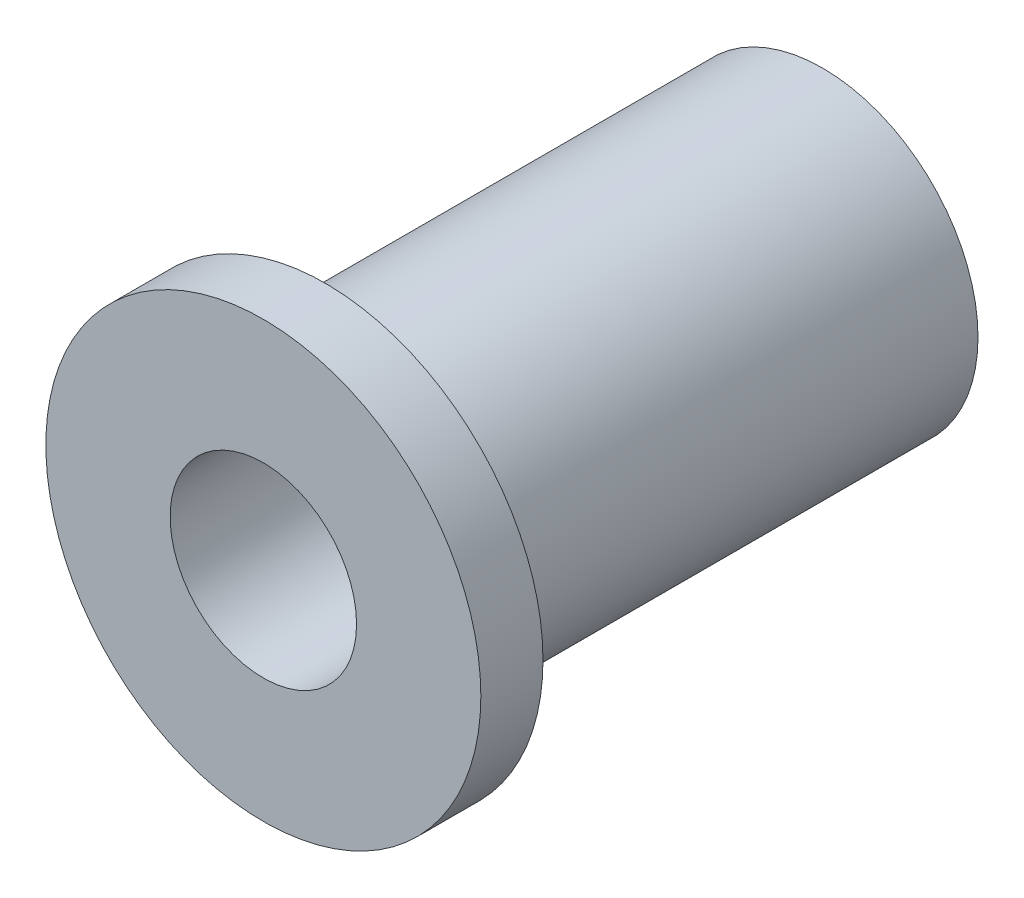
ISO-10303-21;
HEADER;
FILE_DESCRIPTION(('STEP AP214'),'2;1');
FILE_NAME('part.step','',(''),(''),'','','');
FILE_SCHEMA(('AUTOMOTIVE_DESIGN { 1 0 10303 214 1 1 1 1 }'));
ENDSEC;
DATA;
#1=APPLICATION_CONTEXT('core data for automotive mechanical design processes');
#2=APPLICATION_PROTOCOL_DEFINITION('international standard','automotive_design',2000,#1);
#3=PRODUCT_CONTEXT('',#1,'mechanical');
#4=PRODUCT('Part','Part','',(#3));
#5=PRODUCT_RELATED_PRODUCT_CATEGORY('part','',(#4));
#6=PRODUCT_DEFINITION_FORMATION('','',#4);
#7=PRODUCT_DEFINITION_CONTEXT('part definition',#1,'design');
#8=PRODUCT_DEFINITION('design','',#6,#7);
#9=PRODUCT_DEFINITION_SHAPE('','',#8);
#10=(LENGTH_UNIT() NAMED_UNIT(*) SI_UNIT(.MILLI.,.METRE.));
#11=(NAMED_UNIT(*) PLANE_ANGLE_UNIT() SI_UNIT($,.RADIAN.));
#12=(NAMED_UNIT(*) SI_UNIT($,.STERADIAN.) SOLID_ANGLE_UNIT());
#13=UNCERTAINTY_MEASURE_WITH_UNIT(LENGTH_MEASURE(1.E-05),#10,'distance_accuracy_value','');
#14=(GEOMETRIC_REPRESENTATION_CONTEXT(3) GLOBAL_UNCERTAINTY_ASSIGNED_CONTEXT((#13)) GLOBAL_UNIT_ASSIGNED_CONTEXT((#10,
#11,#12)) REPRESENTATION_CONTEXT('',''));
#15=CARTESIAN_POINT('',(0.,0.,0.));
#16=DIRECTION('',(0.,0.,1.));
#17=DIRECTION('',(1.,0.,0.));
#18=AXIS2_PLACEMENT_3D('',#15,#16,#17);
#19=CARTESIAN_POINT('',(0.,0.,0.));
#20=DIRECTION('',(0.,0.,1.));
#21=DIRECTION('',(1.,0.,0.));
#22=AXIS2_PLACEMENT_3D('',#19,#20,#21);
#23=PLANE('',#22);
#24=CARTESIAN_POINT('',(0.,0.,0.));
#25=DIRECTION('',(0.,0.,1.));
#26=DIRECTION('',(1.,0.,0.));
#27=AXIS2_PLACEMENT_3D('',#24,#25,#26);
#28=CIRCLE('',#27,5.55625);
#29=CARTESIAN_POINT('',(5.55625,0.,0.));
#30=VERTEX_POINT('',#29);
#31=EDGE_CURVE('E45',#30,#30,#28,.T.);
#32=ORIENTED_EDGE('',*,*,#31,.F.);
#33=EDGE_LOOP('',(#32));
#34=FACE_BOUND('',#33,.T.);
#35=CARTESIAN_POINT('',(0.,0.,0.));
#36=DIRECTION('',(0.,0.,1.));
#37=DIRECTION('',(1.,0.,0.));
#38=AXIS2_PLACEMENT_3D('',#35,#36,#37);
#39=CIRCLE('',#38,3.96875);
#40=CARTESIAN_POINT('',(3.96875,0.,0.));
#41=VERTEX_POINT('',#40);
#42=EDGE_CURVE('E10',#41,#41,#39,.F.);
#43=ORIENTED_EDGE('',*,*,#42,.F.);
#44=EDGE_LOOP('',(#43));
#45=FACE_BOUND('',#44,.T.);
#46=ADVANCED_FACE('F34',(#34,#45),#23,.F.);
#47=CARTESIAN_POINT('',(0.,0.,1.5875));
#48=DIRECTION('',(0.,0.,-1.));
#49=DIRECTION('',(-1.,0.,0.));
#50=AXIS2_PLACEMENT_3D('',#47,#48,#49);
#51=CYLINDRICAL_SURFACE('',#50,5.55625);
#52=CARTESIAN_POINT('',(0.,0.,1.5875));
#53=DIRECTION('',(0.,0.,1.));
#54=DIRECTION('',(1.,0.,0.));
#55=AXIS2_PLACEMENT_3D('',#52,#53,#54);
#56=CIRCLE('',#55,5.55625);
#57=CARTESIAN_POINT('',(5.55625,0.,1.5875));
#58=VERTEX_POINT('',#57);
#59=EDGE_CURVE('E41',#58,#58,#56,.T.);
#60=ORIENTED_EDGE('',*,*,#59,.F.);
#61=EDGE_LOOP('',(#60));
#62=FACE_BOUND('',#61,.T.);
#63=ORIENTED_EDGE('',*,*,#31,.T.);
#64=EDGE_LOOP('',(#63));
#65=FACE_BOUND('',#64,.T.);
#66=ADVANCED_FACE('F36',(#62,#65),#51,.T.);
#67=CARTESIAN_POINT('',(0.,0.,1.5875));
#68=DIRECTION('',(0.,0.,1.));
#69=DIRECTION('',(1.,0.,0.));
#70=AXIS2_PLACEMENT_3D('',#67,#68,#69);
#71=PLANE('',#70);
#72=CARTESIAN_POINT('',(0.,0.,1.5875));
#73=DIRECTION('',(0.,0.,1.));
#74=DIRECTION('',(1.,0.,0.));
#75=AXIS2_PLACEMENT_3D('',#72,#73,#74);
#76=CIRCLE('',#75,2.38125);
#77=CARTESIAN_POINT('',(2.38125,0.,1.5875));
#78=VERTEX_POINT('',#77);
#79=EDGE_CURVE('E55',#78,#78,#76,.T.);
#80=ORIENTED_EDGE('',*,*,#79,.F.);
#81=EDGE_LOOP('',(#80));
#82=FACE_BOUND('',#81,.T.);
#83=ORIENTED_EDGE('',*,*,#59,.T.);
#84=EDGE_LOOP('',(#83));
#85=FACE_BOUND('',#84,.T.);
#86=ADVANCED_FACE('F70',(#82,#85),#71,.T.);
#87=CARTESIAN_POINT('',(0.,0.,-12.7));
#88=DIRECTION('',(0.,0.,1.));
#89=DIRECTION('',(1.,0.,0.));
#90=AXIS2_PLACEMENT_3D('',#87,#88,#89);
#91=CYLINDRICAL_SURFACE('',#90,3.96875);
#92=CARTESIAN_POINT('',(0.,0.,-12.7));
#93=DIRECTION('',(0.,0.,-1.));
#94=DIRECTION('',(-1.,0.,0.));
#95=AXIS2_PLACEMENT_3D('',#92,#93,#94);
#96=CIRCLE('',#95,3.96875);
#97=CARTESIAN_POINT('',(-3.96875,0.,-12.7));
#98=VERTEX_POINT('',#97);
#99=EDGE_CURVE('E50',#98,#98,#96,.T.);
#100=ORIENTED_EDGE('',*,*,#99,.F.);
#101=EDGE_LOOP('',(#100));
#102=FACE_BOUND('',#101,.T.);
#103=ORIENTED_EDGE('',*,*,#42,.T.);
#104=EDGE_LOOP('',(#103));
#105=FACE_BOUND('',#104,.T.);
#106=ADVANCED_FACE('F72',(#102,#105),#91,.T.);
#107=CARTESIAN_POINT('',(0.,0.,-12.7));
#108=DIRECTION('',(0.,0.,-1.));
#109=DIRECTION('',(-1.,0.,0.));
#110=AXIS2_PLACEMENT_3D('',#107,#108,#109);
#111=PLANE('',#110);
#112=CARTESIAN_POINT('',(0.,0.,-12.7));
#113=DIRECTION('',(0.,0.,1.));
#114=DIRECTION('',(1.,0.,0.));
#115=AXIS2_PLACEMENT_3D('',#112,#113,#114);
#116=CIRCLE('',#115,2.38125);
#117=CARTESIAN_POINT('',(2.38125,0.,-12.7));
#118=VERTEX_POINT('',#117);
#119=EDGE_CURVE('E54',#118,#118,#116,.T.);
#120=ORIENTED_EDGE('',*,*,#119,.T.);
#121=EDGE_LOOP('',(#120));
#122=FACE_BOUND('',#121,.T.);
#123=ORIENTED_EDGE('',*,*,#99,.T.);
#124=EDGE_LOOP('',(#123));
#125=FACE_BOUND('',#124,.T.);
#126=ADVANCED_FACE('F61',(#122,#125),#111,.T.);
#127=CARTESIAN_POINT('',(0.,0.,-12.7));
#128=DIRECTION('',(0.,0.,1.));
#129=DIRECTION('',(1.,0.,0.));
#130=AXIS2_PLACEMENT_3D('',#127,#128,#129);
#131=CYLINDRICAL_SURFACE('',#130,2.38125);
#132=ORIENTED_EDGE('',*,*,#119,.F.);
#133=EDGE_LOOP('',(#132));
#134=FACE_BOUND('',#133,.T.);
#135=ORIENTED_EDGE('',*,*,#79,.T.);
#136=EDGE_LOOP('',(#135));
#137=FACE_BOUND('',#136,.T.);
#138=ADVANCED_FACE('F64',(#134,#137),#131,.F.);
#139=CLOSED_SHELL('',(#46,#66,#86,#106,#126,#138));
#140=MANIFOLD_SOLID_BREP('B2',#139);
#141=ADVANCED_BREP_SHAPE_REPRESENTATION('',(#18,#140),#14);
#142=SHAPE_DEFINITION_REPRESENTATION(#9,#141);
ENDSEC;
END-ISO-10303-21;
